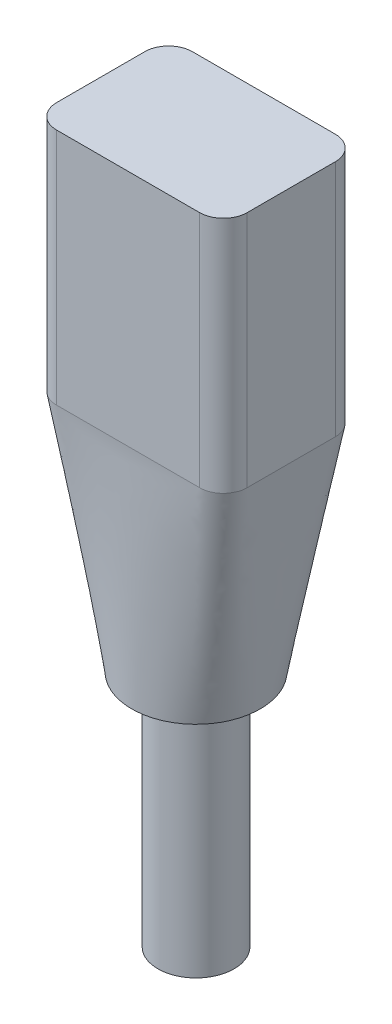
ISO-10303-21;
HEADER;
FILE_DESCRIPTION(('STEP AP214'),'2;1');
FILE_NAME('part.step','',(''),(''),'','','');
FILE_SCHEMA(('AUTOMOTIVE_DESIGN { 1 0 10303 214 1 1 1 1 }'));
ENDSEC;
DATA;
#1=APPLICATION_CONTEXT('core data for automotive mechanical design processes');
#2=APPLICATION_PROTOCOL_DEFINITION('international standard','automotive_design',2000,#1);
#3=PRODUCT_CONTEXT('',#1,'mechanical');
#4=PRODUCT('Part','Part','',(#3));
#5=PRODUCT_RELATED_PRODUCT_CATEGORY('part','',(#4));
#6=PRODUCT_DEFINITION_FORMATION('','',#4);
#7=PRODUCT_DEFINITION_CONTEXT('part definition',#1,'design');
#8=PRODUCT_DEFINITION('design','',#6,#7);
#9=PRODUCT_DEFINITION_SHAPE('','',#8);
#10=(LENGTH_UNIT() NAMED_UNIT(*) SI_UNIT(.MILLI.,.METRE.));
#11=(NAMED_UNIT(*) PLANE_ANGLE_UNIT() SI_UNIT($,.RADIAN.));
#12=(NAMED_UNIT(*) SI_UNIT($,.STERADIAN.) SOLID_ANGLE_UNIT());
#13=UNCERTAINTY_MEASURE_WITH_UNIT(LENGTH_MEASURE(1.E-05),#10,'distance_accuracy_value','');
#14=(GEOMETRIC_REPRESENTATION_CONTEXT(3) GLOBAL_UNCERTAINTY_ASSIGNED_CONTEXT((#13)) GLOBAL_UNIT_ASSIGNED_CONTEXT((#10,
#11,#12)) REPRESENTATION_CONTEXT('',''));
#15=CARTESIAN_POINT('',(0.,0.,0.));
#16=DIRECTION('',(0.,0.,1.));
#17=DIRECTION('',(1.,0.,0.));
#18=AXIS2_PLACEMENT_3D('',#15,#16,#17);
#19=CARTESIAN_POINT('',(-5.08,-12.7,-3.6195));
#20=DIRECTION('',(-1.,0.,0.));
#21=DIRECTION('',(0.,0.,1.));
#22=AXIS2_PLACEMENT_3D('',#19,#20,#21);
#23=PLANE('',#22);
#24=DIRECTION('',(0.,0.,1.));
#25=VECTOR('',#24,1.);
#26=CARTESIAN_POINT('',(-5.08,-12.7,-3.6195));
#27=LINE('',#26,#25);
#28=CARTESIAN_POINT('',(-5.08,-12.7,-2.3495));
#29=VERTEX_POINT('',#28);
#30=CARTESIAN_POINT('',(-5.08,-12.7,2.34949999999864));
#31=VERTEX_POINT('',#30);
#32=EDGE_CURVE('E347',#29,#31,#27,.T.);
#33=ORIENTED_EDGE('',*,*,#32,.T.);
#34=DIRECTION('',(0.,1.,0.));
#35=VECTOR('',#34,1.);
#36=CARTESIAN_POINT('',(-5.08,-12.7,2.3495));
#37=LINE('',#36,#35);
#38=CARTESIAN_POINT('',(-5.08,0.,2.3495));
#39=VERTEX_POINT('',#38);
#40=EDGE_CURVE('E353',#31,#39,#37,.T.);
#41=ORIENTED_EDGE('',*,*,#40,.T.);
#42=DIRECTION('',(0.,0.,1.));
#43=VECTOR('',#42,1.);
#44=CARTESIAN_POINT('',(-5.08,0.,-3.6195));
#45=LINE('',#44,#43);
#46=CARTESIAN_POINT('',(-5.08,0.,-2.3495));
#47=VERTEX_POINT('',#46);
#48=EDGE_CURVE('E349',#47,#39,#45,.T.);
#49=ORIENTED_EDGE('',*,*,#48,.F.);
#50=DIRECTION('',(0.,1.,0.));
#51=VECTOR('',#50,1.);
#52=CARTESIAN_POINT('',(-5.08,-12.7,-2.3495));
#53=LINE('',#52,#51);
#54=EDGE_CURVE('E369',#47,#29,#53,.F.);
#55=ORIENTED_EDGE('',*,*,#54,.T.);
#56=EDGE_LOOP('',(#33,#41,#49,#55));
#57=FACE_BOUND('',#56,.T.);
#58=ADVANCED_FACE('F227',(#57),#23,.T.);
#59=CARTESIAN_POINT('',(-5.08,-12.7,-3.6195));
#60=DIRECTION('',(0.,0.,-1.));
#61=DIRECTION('',(-1.,0.,0.));
#62=AXIS2_PLACEMENT_3D('',#59,#60,#61);
#63=PLANE('',#62);
#64=DIRECTION('',(-1.,0.,0.));
#65=VECTOR('',#64,1.);
#66=CARTESIAN_POINT('',(-5.08,-12.7,-3.6195));
#67=LINE('',#66,#65);
#68=CARTESIAN_POINT('',(3.81,-12.7,-3.6195));
#69=VERTEX_POINT('',#68);
#70=CARTESIAN_POINT('',(-3.80999999998039,-12.7,-3.6195));
#71=VERTEX_POINT('',#70);
#72=EDGE_CURVE('E372',#69,#71,#67,.T.);
#73=ORIENTED_EDGE('',*,*,#72,.T.);
#74=DIRECTION('',(0.,1.,0.));
#75=VECTOR('',#74,1.);
#76=CARTESIAN_POINT('',(-3.81,-12.7,-3.6195));
#77=LINE('',#76,#75);
#78=CARTESIAN_POINT('',(-3.81,0.,-3.6195));
#79=VERTEX_POINT('',#78);
#80=EDGE_CURVE('E360',#71,#79,#77,.T.);
#81=ORIENTED_EDGE('',*,*,#80,.T.);
#82=DIRECTION('',(-1.,0.,0.));
#83=VECTOR('',#82,1.);
#84=CARTESIAN_POINT('',(-5.08,0.,-3.6195));
#85=LINE('',#84,#83);
#86=CARTESIAN_POINT('',(3.81,0.,-3.6195));
#87=VERTEX_POINT('',#86);
#88=EDGE_CURVE('E344',#87,#79,#85,.T.);
#89=ORIENTED_EDGE('',*,*,#88,.F.);
#90=DIRECTION('',(0.,1.,0.));
#91=VECTOR('',#90,1.);
#92=CARTESIAN_POINT('',(3.81,-12.7,-3.6195));
#93=LINE('',#92,#91);
#94=EDGE_CURVE('E329',#87,#69,#93,.F.);
#95=ORIENTED_EDGE('',*,*,#94,.T.);
#96=EDGE_LOOP('',(#73,#81,#89,#95));
#97=FACE_BOUND('',#96,.T.);
#98=ADVANCED_FACE('F471',(#97),#63,.T.);
#99=CARTESIAN_POINT('',(5.08,-12.7,-3.6195));
#100=DIRECTION('',(1.,0.,0.));
#101=DIRECTION('',(0.,0.,-1.));
#102=AXIS2_PLACEMENT_3D('',#99,#100,#101);
#103=PLANE('',#102);
#104=DIRECTION('',(0.,0.,-1.));
#105=VECTOR('',#104,1.);
#106=CARTESIAN_POINT('',(5.08,-12.7,-3.6195));
#107=LINE('',#106,#105);
#108=CARTESIAN_POINT('',(5.08,-12.7,2.3495));
#109=VERTEX_POINT('',#108);
#110=CARTESIAN_POINT('',(5.08,-12.7,-2.3495));
#111=VERTEX_POINT('',#110);
#112=EDGE_CURVE('E232',#109,#111,#107,.T.);
#113=ORIENTED_EDGE('',*,*,#112,.T.);
#114=DIRECTION('',(0.,1.,0.));
#115=VECTOR('',#114,1.);
#116=CARTESIAN_POINT('',(5.08,-12.7,-2.3495));
#117=LINE('',#116,#115);
#118=CARTESIAN_POINT('',(5.08,0.,-2.3495));
#119=VERTEX_POINT('',#118);
#120=EDGE_CURVE('E12',#111,#119,#117,.T.);
#121=ORIENTED_EDGE('',*,*,#120,.T.);
#122=DIRECTION('',(0.,0.,-1.));
#123=VECTOR('',#122,1.);
#124=CARTESIAN_POINT('',(5.08,0.,-3.6195));
#125=LINE('',#124,#123);
#126=CARTESIAN_POINT('',(5.08,0.,2.3495));
#127=VERTEX_POINT('',#126);
#128=EDGE_CURVE('E339',#127,#119,#125,.T.);
#129=ORIENTED_EDGE('',*,*,#128,.F.);
#130=DIRECTION('',(0.,1.,0.));
#131=VECTOR('',#130,1.);
#132=CARTESIAN_POINT('',(5.08,-12.7,2.3495));
#133=LINE('',#132,#131);
#134=EDGE_CURVE('E237',#127,#109,#133,.F.);
#135=ORIENTED_EDGE('',*,*,#134,.T.);
#136=EDGE_LOOP('',(#113,#121,#129,#135));
#137=FACE_BOUND('',#136,.T.);
#138=ADVANCED_FACE('F338',(#137),#103,.T.);
#139=CARTESIAN_POINT('',(-5.08,-12.7,3.6195));
#140=DIRECTION('',(0.,0.,1.));
#141=DIRECTION('',(1.,0.,0.));
#142=AXIS2_PLACEMENT_3D('',#139,#140,#141);
#143=PLANE('',#142);
#144=DIRECTION('',(1.,0.,0.));
#145=VECTOR('',#144,1.);
#146=CARTESIAN_POINT('',(-5.08,0.,3.6195));
#147=LINE('',#146,#145);
#148=CARTESIAN_POINT('',(-3.81,0.,3.6195));
#149=VERTEX_POINT('',#148);
#150=CARTESIAN_POINT('',(3.81,0.,3.6195));
#151=VERTEX_POINT('',#150);
#152=EDGE_CURVE('E345',#149,#151,#147,.T.);
#153=ORIENTED_EDGE('',*,*,#152,.F.);
#154=DIRECTION('',(0.,1.,0.));
#155=VECTOR('',#154,1.);
#156=CARTESIAN_POINT('',(-3.81,-12.7,3.6195));
#157=LINE('',#156,#155);
#158=CARTESIAN_POINT('',(-3.81,-12.7,3.6195));
#159=VERTEX_POINT('',#158);
#160=EDGE_CURVE('E363',#149,#159,#157,.F.);
#161=ORIENTED_EDGE('',*,*,#160,.T.);
#162=DIRECTION('',(1.,0.,0.));
#163=VECTOR('',#162,1.);
#164=CARTESIAN_POINT('',(-5.08,-12.7,3.6195));
#165=LINE('',#164,#163);
#166=CARTESIAN_POINT('',(3.81,-12.7,3.6195));
#167=VERTEX_POINT('',#166);
#168=EDGE_CURVE('E381',#159,#167,#165,.T.);
#169=ORIENTED_EDGE('',*,*,#168,.T.);
#170=DIRECTION('',(0.,1.,0.));
#171=VECTOR('',#170,1.);
#172=CARTESIAN_POINT('',(3.81,-12.7,3.6195));
#173=LINE('',#172,#171);
#174=EDGE_CURVE('E358',#167,#151,#173,.T.);
#175=ORIENTED_EDGE('',*,*,#174,.T.);
#176=EDGE_LOOP('',(#153,#161,#169,#175));
#177=FACE_BOUND('',#176,.T.);
#178=ADVANCED_FACE('F479',(#177),#143,.T.);
#179=CARTESIAN_POINT('',(0.,0.,0.));
#180=DIRECTION('',(0.,1.,0.));
#181=DIRECTION('',(0.,0.,1.));
#182=AXIS2_PLACEMENT_3D('',#179,#180,#181);
#183=PLANE('',#182);
#184=ORIENTED_EDGE('',*,*,#48,.T.);
#185=CARTESIAN_POINT('',(-3.81,0.,2.3495));
#186=DIRECTION('',(0.,1.,0.));
#187=DIRECTION('',(0.,0.,1.));
#188=AXIS2_PLACEMENT_3D('',#185,#186,#187);
#189=CIRCLE('',#188,1.27);
#190=EDGE_CURVE('E356',#39,#149,#189,.T.);
#191=ORIENTED_EDGE('',*,*,#190,.T.);
#192=ORIENTED_EDGE('',*,*,#152,.T.);
#193=CARTESIAN_POINT('',(3.81,0.,2.3495));
#194=DIRECTION('',(0.,1.,0.));
#195=DIRECTION('',(0.,0.,1.));
#196=AXIS2_PLACEMENT_3D('',#193,#194,#195);
#197=CIRCLE('',#196,1.27);
#198=EDGE_CURVE('E334',#151,#127,#197,.T.);
#199=ORIENTED_EDGE('',*,*,#198,.T.);
#200=ORIENTED_EDGE('',*,*,#128,.T.);
#201=CARTESIAN_POINT('',(3.81,0.,-2.3495));
#202=DIRECTION('',(0.,1.,0.));
#203=DIRECTION('',(0.,0.,1.));
#204=AXIS2_PLACEMENT_3D('',#201,#202,#203);
#205=CIRCLE('',#204,1.27);
#206=EDGE_CURVE('E326',#119,#87,#205,.T.);
#207=ORIENTED_EDGE('',*,*,#206,.T.);
#208=ORIENTED_EDGE('',*,*,#88,.T.);
#209=CARTESIAN_POINT('',(-3.81,0.,-2.3495));
#210=DIRECTION('',(0.,1.,0.));
#211=DIRECTION('',(0.,0.,1.));
#212=AXIS2_PLACEMENT_3D('',#209,#210,#211);
#213=CIRCLE('',#212,1.27);
#214=EDGE_CURVE('E254',#79,#47,#213,.T.);
#215=ORIENTED_EDGE('',*,*,#214,.T.);
#216=EDGE_LOOP('',(#184,#191,#192,#199,#200,#207,#208,#215));
#217=FACE_BOUND('',#216,.T.);
#218=ADVANCED_FACE('F342',(#217),#183,.T.);
#219=CARTESIAN_POINT('',(-3.81,-12.7,2.3495));
#220=DIRECTION('',(0.,1.,0.));
#221=DIRECTION('',(0.,0.,1.));
#222=AXIS2_PLACEMENT_3D('',#219,#220,#221);
#223=CYLINDRICAL_SURFACE('',#222,1.27);
#224=CARTESIAN_POINT('',(-3.81000000000032,-12.7,3.6195));
#225=CARTESIAN_POINT('',(-3.82785191917642,-12.7000193499349,3.61950011683258));
#226=CARTESIAN_POINT('',(-3.84570103696801,-12.7002239515164,3.61912358872368));
#227=CARTESIAN_POINT('',(-3.88136625776914,-12.7007886712782,3.61761883209057));
#228=CARTESIAN_POINT('',(-3.89918235917228,-12.7011487968357,3.61649056790617));
#229=CARTESIAN_POINT('',(-3.93474418231002,-12.701809381901,3.61348462654775));
#230=CARTESIAN_POINT('',(-3.95248993286943,-12.702109869021,3.61160729740527));
#231=CARTESIAN_POINT('',(-3.98788705216084,-12.7025529482621,3.60710669181182));
#232=CARTESIAN_POINT('',(-4.0055384244881,-12.702695546441,3.60448344398539));
#233=CARTESIAN_POINT('',(-4.05828273857642,-12.7028085385177,3.59550426741488));
#234=CARTESIAN_POINT('',(-4.09319360234731,-12.7024648407007,3.58803655849395));
#235=CARTESIAN_POINT('',(-4.16225257597011,-12.7012033336999,3.57019262043896));
#236=CARTESIAN_POINT('',(-4.19640063774621,-12.7002854884356,3.55981620853839));
#237=CARTESIAN_POINT('',(-4.24688843294884,-12.6990932954439,3.54212196166854));
#238=CARTESIAN_POINT('',(-4.26360409209781,-12.6987265129961,3.53586500896526));
#239=CARTESIAN_POINT('',(-4.2967605979294,-12.6982227320734,3.52265067222018));
#240=CARTESIAN_POINT('',(-4.31320145550908,-12.6980857244654,3.51569331602954));
#241=CARTESIAN_POINT('',(-4.34577484981715,-12.6980561357246,3.50109188475384));
#242=CARTESIAN_POINT('',(-4.36190739245442,-12.6981635499026,3.49344782284559));
#243=CARTESIAN_POINT('',(-4.39383449040807,-12.6984938179662,3.47748755817256));
#244=CARTESIAN_POINT('',(-4.40962903168678,-12.6987166766368,3.46917132755995));
#245=CARTESIAN_POINT('',(-4.45645426318381,-12.6994455612716,3.44324090352426));
#246=CARTESIAN_POINT('',(-4.48694382936055,-12.700012067434,3.42463723422937));
#247=CARTESIAN_POINT('',(-4.54624663088929,-12.700912055996,3.38492968559296));
#248=CARTESIAN_POINT('',(-4.57505989032358,-12.7012455417439,3.36382584218288));
#249=CARTESIAN_POINT('',(-4.63064459138849,-12.7015606067847,3.31939726595767));
#250=CARTESIAN_POINT('',(-4.65742708851336,-12.7015442531216,3.29608638808376));
#251=CARTESIAN_POINT('',(-4.7089465915668,-12.7012756119455,3.24730483113287));
#252=CARTESIAN_POINT('',(-4.73368356028614,-12.7010233201417,3.22183411278433));
#253=CARTESIAN_POINT('',(-4.78093853046815,-12.700265221155,3.16891265705702));
#254=CARTESIAN_POINT('',(-4.8034563423054,-12.6997593923299,3.14146175081909));
#255=CARTESIAN_POINT('',(-4.84611635428077,-12.6986627965061,3.08476929564828));
#256=CARTESIAN_POINT('',(-4.86625861570685,-12.6980720316996,3.05552779294145));
#257=CARTESIAN_POINT('',(-4.89463321448037,-12.697419706931,3.0104003304514));
#258=CARTESIAN_POINT('',(-4.90380853542598,-12.6972410630343,2.99510137900231));
#259=CARTESIAN_POINT('',(-4.92150744988578,-12.6970372788857,2.9641293161236));
#260=CARTESIAN_POINT('',(-4.930031068617,-12.6970121326914,2.94845621920203));
#261=CARTESIAN_POINT('',(-4.94641115897224,-12.6971950511334,2.91676351719255));
#262=CARTESIAN_POINT('',(-4.95426754504337,-12.6974031456275,2.90074386799895));
#263=CARTESIAN_POINT('',(-4.96929578683642,-12.6981671967656,2.86839442962313));
#264=CARTESIAN_POINT('',(-4.97646761848739,-12.6987231656367,2.85206462955928));
#265=CARTESIAN_POINT('',(-4.99011267101932,-12.6999717301686,2.81912925284985));
#266=CARTESIAN_POINT('',(-4.99658618255505,-12.7006642686443,2.80252379428553));
#267=CARTESIAN_POINT('',(-5.00882893680099,-12.7020019375051,2.76905554786393));
#268=CARTESIAN_POINT('',(-5.01459820004213,-12.7026470692721,2.75219276752448));
#269=CARTESIAN_POINT('',(-5.03083027449232,-12.7042964310123,2.7012688820704));
#270=CARTESIAN_POINT('',(-5.04022751685431,-12.7050160080144,2.66684774038221));
#271=CARTESIAN_POINT('',(-5.05344755148205,-12.7052315084487,2.60892953024577));
#272=CARTESIAN_POINT('',(-5.05808443678673,-12.7050552759196,2.58561426207882));
#273=CARTESIAN_POINT('',(-5.06604242081595,-12.7042910060763,2.53876636869477));
#274=CARTESIAN_POINT('',(-5.06936353066868,-12.703702972245,2.51523374531768));
#275=CARTESIAN_POINT('',(-5.07467847043188,-12.7023703552846,2.46804072917893));
#276=CARTESIAN_POINT('',(-5.07667323363999,-12.7016258827217,2.44438043809559));
#277=CARTESIAN_POINT('',(-5.07933398259116,-12.7004554511909,2.39698317802484));
#278=CARTESIAN_POINT('',(-5.08000023111397,-12.700029429244,2.3732462251317));
#279=CARTESIAN_POINT('',(-5.08,-12.7,2.34949999999728));
#280=B_SPLINE_CURVE_WITH_KNOTS('',3,(#224,#225,#226,#227,#228,#229,#230,#231,#232,#233,#234,
#235,#236,#237,#238,#239,#240,#241,#242,#243,#244,#245,#246,#247,#248,#249,#250,#251,#252,#253,
#254,#255,#256,#257,#258,#259,#260,#261,#262,#263,#264,#265,#266,#267,#268,#269,#270,#271,#272,
#273,#274,#275,#276,#277,#278,#279),.UNSPECIFIED.,.F.,.F.,(4,2,2,2,2,2,2,2,2,2,2,2,2,2,2,2,2,2,
2,2,2,2,2,2,2,2,2,4),(0.,0.0535475170581482,0.107097574436909,0.160622780237025,
0.214145932291212,0.321109027564496,0.428078845303761,0.481621278339773,0.535161583130668,
0.58870086078676,0.642242357705069,0.749268755249208,0.85629361484177,0.962686288185609,
1.06908089644234,1.17548458817631,1.28188553415,1.33539302985421,1.38889845408494,
1.4424107284819,1.49592488383444,1.54941667887891,1.60290691410644,1.70980799578122,
1.78108795335472,1.85236730806393,1.92359645308274,1.99481150760326),.UNSPECIFIED.);
#281=EDGE_CURVE('E374',#159,#31,#280,.T.);
#282=ORIENTED_EDGE('',*,*,#281,.F.);
#283=ORIENTED_EDGE('',*,*,#160,.F.);
#284=ORIENTED_EDGE('',*,*,#190,.F.);
#285=ORIENTED_EDGE('',*,*,#40,.F.);
#286=EDGE_LOOP('',(#282,#283,#284,#285));
#287=FACE_BOUND('',#286,.T.);
#288=ADVANCED_FACE('F458',(#287),#223,.T.);
#289=CARTESIAN_POINT('',(-3.81,-12.7,-2.3495));
#290=DIRECTION('',(0.,1.,0.));
#291=DIRECTION('',(0.,0.,1.));
#292=AXIS2_PLACEMENT_3D('',#289,#290,#291);
#293=CYLINDRICAL_SURFACE('',#292,1.27);
#294=CARTESIAN_POINT('',(-5.08,-12.7,-2.34949999991347));
#295=CARTESIAN_POINT('',(-5.08000011063295,-12.7000091921465,-2.36735982363288));
#296=CARTESIAN_POINT('',(-5.0796232570443,-12.7002572858356,-2.38521535779433));
#297=CARTESIAN_POINT('',(-5.0781175893252,-12.7010062257201,-2.4208892484536));
#298=CARTESIAN_POINT('',(-5.07698880334756,-12.7015070624524,-2.43870760631828));
#299=CARTESIAN_POINT('',(-5.07398164235616,-12.7025363339921,-2.47427511028815));
#300=CARTESIAN_POINT('',(-5.07210346874928,-12.7030647613511,-2.49202427369696));
#301=CARTESIAN_POINT('',(-5.06760071942922,-12.7039961107308,-2.52742978552736));
#302=CARTESIAN_POINT('',(-5.06497615600962,-12.7043990348185,-2.54508613547278));
#303=CARTESIAN_POINT('',(-5.05599120362284,-12.7052449499517,-2.59784966798296));
#304=CARTESIAN_POINT('',(-5.04851701716056,-12.7053263694605,-2.63278129639566));
#305=CARTESIAN_POINT('',(-5.03065756864486,-12.7043290692299,-2.70187612441862));
#306=CARTESIAN_POINT('',(-5.02027199415224,-12.7032502249402,-2.73603924112981));
#307=CARTESIAN_POINT('',(-5.00256865777317,-12.7013209845814,-2.78653425454667));
#308=CARTESIAN_POINT('',(-4.99630865630682,-12.7006255261085,-2.80325152705573));
#309=CARTESIAN_POINT('',(-4.98308856704644,-12.6992995685177,-2.83641033697837));
#310=CARTESIAN_POINT('',(-4.9761285209025,-12.6986690655396,-2.85285189072837));
#311=CARTESIAN_POINT('',(-4.96151891115244,-12.6977215927962,-2.88543169940895));
#312=CARTESIAN_POINT('',(-4.95386948335196,-12.6974045614249,-2.90157001332294));
#313=CARTESIAN_POINT('',(-4.93789605543682,-12.6970518537527,-2.93351155803859));
#314=CARTESIAN_POINT('',(-4.92957202125053,-12.6970161916716,-2.9493147718648));
#315=CARTESIAN_POINT('',(-4.90361761833299,-12.6971681064196,-2.99616396314081));
#316=CARTESIAN_POINT('',(-4.88499686119622,-12.6976142593706,-3.02666752082151));
#317=CARTESIAN_POINT('',(-4.84525237287888,-12.6986607741201,-3.08599728045676));
#318=CARTESIAN_POINT('',(-4.82412810670966,-12.6992611689115,-3.11482312192138));
#319=CARTESIAN_POINT('',(-4.77979243358714,-12.7002773278402,-3.17025994056578));
#320=CARTESIAN_POINT('',(-4.75660922744011,-12.7006952285141,-3.19689341159178));
#321=CARTESIAN_POINT('',(-4.70810675116857,-12.7012898393158,-3.24813721765304));
#322=CARTESIAN_POINT('',(-4.68278765009816,-12.7014665685132,-3.27274771250113));
#323=CARTESIAN_POINT('',(-4.63018327630337,-12.7015476151081,-3.31978059264586));
#324=CARTESIAN_POINT('',(-4.60289762877667,-12.7014518804424,-3.34220255890551));
#325=CARTESIAN_POINT('',(-4.54655467768323,-12.700927424684,-3.38469675868059));
#326=CARTESIAN_POINT('',(-4.51749726823965,-12.7004986836735,-3.40476885156274));
#327=CARTESIAN_POINT('',(-4.4575541160535,-12.6994971849009,-3.44258769354971));
#328=CARTESIAN_POINT('',(-4.42665461061673,-12.6989232009051,-3.46031258044468));
#329=CARTESIAN_POINT('',(-4.36347240852764,-12.6981303668283,-3.4931059164676));
#330=CARTESIAN_POINT('',(-4.33118989777306,-12.6979114691708,-3.50817472123092));
#331=CARTESIAN_POINT('',(-4.2654980189181,-12.6985613219576,-3.53553863292688));
#332=CARTESIAN_POINT('',(-4.23208910129435,-12.6994296425025,-3.54783483391258));
#333=CARTESIAN_POINT('',(-4.16436065238176,-12.7010970945011,-3.5695790637036));
#334=CARTESIAN_POINT('',(-4.13004127807988,-12.7018962377826,-3.57902758009709));
#335=CARTESIAN_POINT('',(-4.07199426397686,-12.7026426374711,-3.59241412823473));
#336=CARTESIAN_POINT('',(-4.04844953664011,-12.7027823544769,-3.59714505489341));
#337=CARTESIAN_POINT('',(-4.00113292283068,-12.7026911058883,-3.60526440233674));
#338=CARTESIAN_POINT('',(-3.97736106673197,-12.7024601891879,-3.60865300012745));
#339=CARTESIAN_POINT('',(-3.92969766653269,-12.7017430226215,-3.61407386396179));
#340=CARTESIAN_POINT('',(-3.9058063149383,-12.7012571004672,-3.61610786322767));
#341=CARTESIAN_POINT('',(-3.86991194050898,-12.7006060720282,-3.61814267769481));
#342=CARTESIAN_POINT('',(-3.85793662563014,-12.7004020250666,-3.61865158516433));
#343=CARTESIAN_POINT('',(-3.83397473693634,-12.7001007129684,-3.61933024933811));
#344=CARTESIAN_POINT('',(-3.82198816273237,-12.7000034516682,-3.61949999385805));
#345=CARTESIAN_POINT('',(-3.80999999996079,-12.7,-3.6195));
#346=B_SPLINE_CURVE_WITH_KNOTS('',3,(#294,#295,#296,#297,#298,#299,#300,#301,#302,#303,#304,
#305,#306,#307,#308,#309,#310,#311,#312,#313,#314,#315,#316,#317,#318,#319,#320,#321,#322,#323,
#324,#325,#326,#327,#328,#329,#330,#331,#332,#333,#334,#335,#336,#337,#338,#339,#340,#341,#342,
#343,#344,#345),.UNSPECIFIED.,.F.,.F.,(4,2,2,2,2,2,2,2,2,2,2,2,2,2,2,2,2,2,2,2,2,2,2,2,2,4),(0.,
0.0535682745791533,0.107134543642069,0.160686425817909,0.214237426007252,0.321249445453936,
0.428272953426274,0.481853902618608,0.535431665824858,0.588998897384116,0.642568836093322,
0.74964962410285,0.856753336197993,0.962567130783647,1.06837255814963,1.17419820447558,
1.28003018093374,1.38678734423696,1.4935302024432,1.6002308665509,1.7069132506931,1.77892165409,
1.85092055894285,1.92282716257851,1.95878624972736,1.99474662867116),.UNSPECIFIED.);
#347=EDGE_CURVE('E449',#29,#71,#346,.T.);
#348=ORIENTED_EDGE('',*,*,#347,.F.);
#349=ORIENTED_EDGE('',*,*,#54,.F.);
#350=ORIENTED_EDGE('',*,*,#214,.F.);
#351=ORIENTED_EDGE('',*,*,#80,.F.);
#352=EDGE_LOOP('',(#348,#349,#350,#351));
#353=FACE_BOUND('',#352,.T.);
#354=ADVANCED_FACE('F455',(#353),#293,.T.);
#355=CARTESIAN_POINT('',(3.81,-12.7,-2.3495));
#356=DIRECTION('',(0.,1.,0.));
#357=DIRECTION('',(0.,0.,1.));
#358=AXIS2_PLACEMENT_3D('',#355,#356,#357);
#359=CYLINDRICAL_SURFACE('',#358,1.27);
#360=CARTESIAN_POINT('',(3.81000000000032,-12.7,-3.6195));
#361=CARTESIAN_POINT('',(3.82785191917642,-12.7000193499349,-3.61950011683258));
#362=CARTESIAN_POINT('',(3.84570103696801,-12.7002239515164,-3.61912358872368));
#363=CARTESIAN_POINT('',(3.88136625776914,-12.7007886712781,-3.61761883209057));
#364=CARTESIAN_POINT('',(3.89918235917228,-12.7011487968357,-3.61649056790617));
#365=CARTESIAN_POINT('',(3.93474418231002,-12.701809381901,-3.61348462654775));
#366=CARTESIAN_POINT('',(3.95248993286943,-12.702109869021,-3.61160729740527));
#367=CARTESIAN_POINT('',(3.98788705216084,-12.7025529482621,-3.60710669181182));
#368=CARTESIAN_POINT('',(4.0055384244881,-12.702695546441,-3.60448344398539));
#369=CARTESIAN_POINT('',(4.05828273857642,-12.7028085385177,-3.59550426741488));
#370=CARTESIAN_POINT('',(4.09319360234731,-12.7024648407007,-3.58803655849395));
#371=CARTESIAN_POINT('',(4.16225257597011,-12.7012033336999,-3.57019262043897));
#372=CARTESIAN_POINT('',(4.19640063774622,-12.7002854884356,-3.55981620853839));
#373=CARTESIAN_POINT('',(4.24688843294884,-12.6990932954439,-3.54212196166854));
#374=CARTESIAN_POINT('',(4.26360409209781,-12.6987265129961,-3.53586500896526));
#375=CARTESIAN_POINT('',(4.29676059792941,-12.6982227320734,-3.52265067222018));
#376=CARTESIAN_POINT('',(4.31320145550908,-12.6980857244654,-3.51569331602954));
#377=CARTESIAN_POINT('',(4.34577484981715,-12.6980561357246,-3.50109188475384));
#378=CARTESIAN_POINT('',(4.36190739245442,-12.6981635499026,-3.49344782284559));
#379=CARTESIAN_POINT('',(4.39383449040807,-12.6984938179663,-3.47748755817256));
#380=CARTESIAN_POINT('',(4.40962903168678,-12.6987166766369,-3.46917132755995));
#381=CARTESIAN_POINT('',(4.45645426318381,-12.6994455612716,-3.44324090352426));
#382=CARTESIAN_POINT('',(4.48694382936055,-12.700012067434,-3.42463723422937));
#383=CARTESIAN_POINT('',(4.54624663088929,-12.700912055996,-3.38492968559295));
#384=CARTESIAN_POINT('',(4.57505989032359,-12.7012455417439,-3.36382584218288));
#385=CARTESIAN_POINT('',(4.6306445913885,-12.7015606067847,-3.31939726595767));
#386=CARTESIAN_POINT('',(4.65742708851336,-12.7015442531216,-3.29608638808376));
#387=CARTESIAN_POINT('',(4.7089465915668,-12.7012756119455,-3.24730483113286));
#388=CARTESIAN_POINT('',(4.73368356028614,-12.7010233201417,-3.22183411278432));
#389=CARTESIAN_POINT('',(4.78093853046816,-12.700265221155,-3.16891265705701));
#390=CARTESIAN_POINT('',(4.80345634230541,-12.6997593923299,-3.14146175081908));
#391=CARTESIAN_POINT('',(4.84611635428078,-12.6986627965061,-3.08476929564827));
#392=CARTESIAN_POINT('',(4.86625861570686,-12.6980720316996,-3.05552779294143));
#393=CARTESIAN_POINT('',(4.89463321448038,-12.697419706931,-3.01040033045138));
#394=CARTESIAN_POINT('',(4.90380853542599,-12.6972410630343,-2.99510137900229));
#395=CARTESIAN_POINT('',(4.92150744988579,-12.6970372788857,-2.96412931612359));
#396=CARTESIAN_POINT('',(4.93003106861701,-12.6970121326914,-2.94845621920202));
#397=CARTESIAN_POINT('',(4.94641115897225,-12.6971950511334,-2.91676351719253));
#398=CARTESIAN_POINT('',(4.95426754504338,-12.6974031456275,-2.90074386799893));
#399=CARTESIAN_POINT('',(4.96929578683642,-12.6981671967656,-2.86839442962311));
#400=CARTESIAN_POINT('',(4.9764676184874,-12.6987231656368,-2.85206462955926));
#401=CARTESIAN_POINT('',(4.99011267101932,-12.6999717301686,-2.81912925284983));
#402=CARTESIAN_POINT('',(4.99658618255506,-12.7006642686443,-2.80252379428551));
#403=CARTESIAN_POINT('',(5.008828936801,-12.7020019375051,-2.76905554786392));
#404=CARTESIAN_POINT('',(5.01459820004213,-12.7026470692721,-2.75219276752446));
#405=CARTESIAN_POINT('',(5.03083027449232,-12.7042964310123,-2.70126888207038));
#406=CARTESIAN_POINT('',(5.04022751685431,-12.7050160080143,-2.66684774038219));
#407=CARTESIAN_POINT('',(5.053447551482,-12.7052315084487,-2.60892953024597));
#408=CARTESIAN_POINT('',(5.05808443678664,-12.7050552759196,-2.58561426207925));
#409=CARTESIAN_POINT('',(5.06604242081581,-12.7042910060763,-2.53876636869566));
#410=CARTESIAN_POINT('',(5.06936353066853,-12.7037029722451,-2.5152337453188));
#411=CARTESIAN_POINT('',(5.07467847043173,-12.7023703552847,-2.46804072918051));
#412=CARTESIAN_POINT('',(5.07667323363985,-12.7016258827218,-2.44438043809739));
#413=CARTESIAN_POINT('',(5.07933398259108,-12.700455451191,-2.39698317802711));
#414=CARTESIAN_POINT('',(5.08000023111392,-12.7000294292441,-2.37324622513419));
#415=CARTESIAN_POINT('',(5.08,-12.7,-2.3495));
#416=B_SPLINE_CURVE_WITH_KNOTS('',3,(#360,#361,#362,#363,#364,#365,#366,#367,#368,#369,#370,
#371,#372,#373,#374,#375,#376,#377,#378,#379,#380,#381,#382,#383,#384,#385,#386,#387,#388,#389,
#390,#391,#392,#393,#394,#395,#396,#397,#398,#399,#400,#401,#402,#403,#404,#405,#406,#407,#408,
#409,#410,#411,#412,#413,#414,#415),.UNSPECIFIED.,.F.,.F.,(4,2,2,2,2,2,2,2,2,2,2,2,2,2,2,2,2,2,
2,2,2,2,2,2,2,2,2,4),(0.,0.0535475170581477,0.107097574436908,0.160622780237024,
0.214145932291211,0.321109027564496,0.428078845303761,0.481621278339773,0.535161583130669,
0.588700860786761,0.64224235770507,0.749268755249208,0.85629361484177,0.962686288185613,
1.06908089644235,1.17548458817632,1.28188553415002,1.33539302985422,1.38889845408495,
1.44241072848192,1.49592488383446,1.54941667887893,1.60290691410645,1.70980799578124,
1.78108795335405,1.85236730806258,1.9235964530807,1.99481150760054),.UNSPECIFIED.);
#417=EDGE_CURVE('E245',#69,#111,#416,.T.);
#418=ORIENTED_EDGE('',*,*,#417,.F.);
#419=ORIENTED_EDGE('',*,*,#94,.F.);
#420=ORIENTED_EDGE('',*,*,#206,.F.);
#421=ORIENTED_EDGE('',*,*,#120,.F.);
#422=EDGE_LOOP('',(#418,#419,#420,#421));
#423=FACE_BOUND('',#422,.T.);
#424=ADVANCED_FACE('F327',(#423),#359,.T.);
#425=CARTESIAN_POINT('',(3.81,-12.7,2.3495));
#426=DIRECTION('',(0.,1.,0.));
#427=DIRECTION('',(0.,0.,1.));
#428=AXIS2_PLACEMENT_3D('',#425,#426,#427);
#429=CYLINDRICAL_SURFACE('',#428,1.27);
#430=CARTESIAN_POINT('',(5.08,-12.7,2.3495));
#431=CARTESIAN_POINT('',(5.08000011069876,-12.7000092039954,2.36736551594073));
#432=CARTESIAN_POINT('',(5.07962301684566,-12.7002574500653,2.3852267382343));
#433=CARTESIAN_POINT('',(5.07811638983661,-12.7010067822513,2.42091197458062));
#434=CARTESIAN_POINT('',(5.0769868847493,-12.7015078589354,2.43873598999648));
#435=CARTESIAN_POINT('',(5.0739778115617,-12.702537503351,2.47431471908833));
#436=CARTESIAN_POINT('',(5.07209844630611,-12.7030660636144,2.49206945019592));
#437=CARTESIAN_POINT('',(5.06759284370256,-12.7039974726096,2.52748600998534));
#438=CARTESIAN_POINT('',(5.06496661870671,-12.7044003234203,2.54514784019871));
#439=CARTESIAN_POINT('',(5.0559759797012,-12.7052456292899,2.5979276628204));
#440=CARTESIAN_POINT('',(5.04849706740373,-12.7053261225363,2.63286992783118));
#441=CARTESIAN_POINT('',(5.03062638395349,-12.70432645795,2.70198528453513));
#442=CARTESIAN_POINT('',(5.02023429867292,-12.7032461749149,2.73615829284972));
#443=CARTESIAN_POINT('',(5.00251990934555,-12.7013156068899,2.78666748822365));
#444=CARTESIAN_POINT('',(4.99625600027274,-12.700619843658,2.80338939472125));
#445=CARTESIAN_POINT('',(4.98302767266888,-12.6992939135793,2.836557230017));
#446=CARTESIAN_POINT('',(4.97606329603866,-12.6986637428135,2.85300317525412));
#447=CARTESIAN_POINT('',(4.9614446233039,-12.697717723456,2.88559147836051));
#448=CARTESIAN_POINT('',(4.9537904630659,-12.6974018131115,2.9017338952619));
#449=CARTESIAN_POINT('',(4.9378071959364,-12.6970509893186,2.93368331493466));
#450=CARTESIAN_POINT('',(4.92947805472662,-12.6970160901669,2.94949030059996));
#451=CARTESIAN_POINT('',(4.90350782103624,-12.6971700373351,2.99635023930256));
#452=CARTESIAN_POINT('',(4.88487580055233,-12.6976172035377,3.02686026460729));
#453=CARTESIAN_POINT('',(4.84510750894267,-12.698664832369,3.08620141507264));
#454=CARTESIAN_POINT('',(4.82397070407108,-12.6992653277024,3.11503218043964));
#455=CARTESIAN_POINT('',(4.77961604198209,-12.7002808494439,3.17046831507512));
#456=CARTESIAN_POINT('',(4.75642713124809,-12.7006980762233,3.19709678322711));
#457=CARTESIAN_POINT('',(4.70791368862736,-12.7012914757522,3.24833012338433));
#458=CARTESIAN_POINT('',(4.68258932600212,-12.7014676675878,3.2729351554676));
#459=CARTESIAN_POINT('',(4.62997491612572,-12.7015472620749,3.31995668048919));
#460=CARTESIAN_POINT('',(4.60268449483867,-12.701450612685,3.34237275506505));
#461=CARTESIAN_POINT('',(4.54633251116559,-12.7009245986719,3.38485479512538));
#462=CARTESIAN_POINT('',(4.51727084282001,-12.7004952141258,3.40492061980298));
#463=CARTESIAN_POINT('',(4.45731956771705,-12.6994929877004,3.44272661014439));
#464=CARTESIAN_POINT('',(4.42641619770022,-12.6989189240798,3.46044490251381));
#465=CARTESIAN_POINT('',(4.36322681924668,-12.698128491692,3.49322474358956));
#466=CARTESIAN_POINT('',(4.33094099684722,-12.6979120749504,3.50828664837952));
#467=CARTESIAN_POINT('',(4.2652431849506,-12.6985659920673,3.53563647253106));
#468=CARTESIAN_POINT('',(4.23183164672464,-12.6994358953744,3.54792548861912));
#469=CARTESIAN_POINT('',(4.16409851577478,-12.7011035915483,3.56965516604041));
#470=CARTESIAN_POINT('',(4.12977708103573,-12.7019013968288,3.57909631836839));
#471=CARTESIAN_POINT('',(4.07174932852061,-12.7026445702059,3.59246529503553));
#472=CARTESIAN_POINT('',(4.04822602749775,-12.7027829320754,3.59718731393767));
#473=CARTESIAN_POINT('',(4.00095292401153,-12.702689749933,3.60529135136301));
#474=CARTESIAN_POINT('',(3.97720315177918,-12.7024582546238,3.60867354624073));
#475=CARTESIAN_POINT('',(3.92958436438618,-12.7017408828768,3.61408415239866));
#476=CARTESIAN_POINT('',(3.90571554147051,-12.7012553334202,3.61611429622565));
#477=CARTESIAN_POINT('',(3.86985511612233,-12.7006050975898,3.61814525245281));
#478=CARTESIAN_POINT('',(3.85789114775229,-12.7004013538361,3.61865319466173));
#479=CARTESIAN_POINT('',(3.83395198110814,-12.7001005224764,3.61933057150045));
#480=CARTESIAN_POINT('',(3.82197678244535,-12.7000034387096,3.61949999394597));
#481=CARTESIAN_POINT('',(3.81,-12.7,3.6195));
#482=B_SPLINE_CURVE_WITH_KNOTS('',3,(#430,#431,#432,#433,#434,#435,#436,#437,#438,#439,#440,
#441,#442,#443,#444,#445,#446,#447,#448,#449,#450,#451,#452,#453,#454,#455,#456,#457,#458,#459,
#460,#461,#462,#463,#464,#465,#466,#467,#468,#469,#470,#471,#472,#473,#474,#475,#476,#477,#478,
#479,#480,#481),.UNSPECIFIED.,.F.,.F.,(4,2,2,2,2,2,2,2,2,2,2,2,2,2,2,2,2,2,2,2,2,2,2,2,2,4),(0.,
0.0535853411238205,0.107168683362892,0.160737540588337,0.214305511905502,0.321351541347002,
0.428409118018363,0.482007209939625,0.535602097614395,0.589186451692159,0.642773531888938,
0.749888402386046,0.857026139231687,0.962839834090729,1.06864514974938,1.17447064793288,
1.28030248303523,1.38705985200915,1.49380289946898,1.60050365387287,1.70718600167493,
1.77912621832139,1.85105696267763,1.92289535519208,1.95882031200075,1.99474656182764),.UNSPECIFIED.);
#483=EDGE_CURVE('E366',#109,#167,#482,.T.);
#484=ORIENTED_EDGE('',*,*,#483,.F.);
#485=ORIENTED_EDGE('',*,*,#134,.F.);
#486=ORIENTED_EDGE('',*,*,#198,.F.);
#487=ORIENTED_EDGE('',*,*,#174,.F.);
#488=EDGE_LOOP('',(#484,#485,#486,#487));
#489=FACE_BOUND('',#488,.T.);
#490=ADVANCED_FACE('F229',(#489),#429,.T.);
#491=CARTESIAN_POINT('',(0.,-24.9174,0.));
#492=DIRECTION('',(0.,-1.,0.));
#493=DIRECTION('',(0.,0.,-1.));
#494=AXIS2_PLACEMENT_3D('',#491,#492,#493);
#495=PLANE('',#494);
#496=CARTESIAN_POINT('',(0.,-24.9174,0.));
#497=DIRECTION('',(0.,-1.,0.));
#498=DIRECTION('',(0.,0.,-1.));
#499=AXIS2_PLACEMENT_3D('',#496,#497,#498);
#500=CIRCLE('',#499,2.032);
#501=CARTESIAN_POINT('',(0.,-24.9174,-2.032));
#502=VERTEX_POINT('',#501);
#503=EDGE_CURVE('E557',#502,#502,#500,.T.);
#504=ORIENTED_EDGE('',*,*,#503,.F.);
#505=EDGE_LOOP('',(#504));
#506=FACE_BOUND('',#505,.T.);
#507=CARTESIAN_POINT('',(0.,-24.9174,0.));
#508=DIRECTION('',(0.,1.,0.));
#509=DIRECTION('',(0.,0.,-1.));
#510=AXIS2_PLACEMENT_3D('',#507,#508,#509);
#511=CIRCLE('',#510,3.429);
#512=CARTESIAN_POINT('',(2.35970735806498,-24.9174,-2.48793532558505));
#513=VERTEX_POINT('',#512);
#514=CARTESIAN_POINT('',(-2.35970735806292,-24.9174,-2.487935325587));
#515=VERTEX_POINT('',#514);
#516=EDGE_CURVE('E556',#513,#515,#511,.T.);
#517=ORIENTED_EDGE('',*,*,#516,.F.);
#518=CARTESIAN_POINT('',(0.,-24.9174,0.));
#519=DIRECTION('',(0.,1.,0.));
#520=DIRECTION('',(0.,0.,-1.));
#521=AXIS2_PLACEMENT_3D('',#518,#519,#520);
#522=CIRCLE('',#521,3.429);
#523=CARTESIAN_POINT('',(3.28253973867596,-24.9174,-0.991450384040045));
#524=VERTEX_POINT('',#523);
#525=EDGE_CURVE('E559',#524,#513,#522,.T.);
#526=ORIENTED_EDGE('',*,*,#525,.F.);
#527=CARTESIAN_POINT('',(0.,-24.9174,0.));
#528=DIRECTION('',(0.,1.,0.));
#529=DIRECTION('',(0.,0.,-1.));
#530=AXIS2_PLACEMENT_3D('',#527,#528,#529);
#531=CIRCLE('',#530,3.429);
#532=CARTESIAN_POINT('',(3.28253973866406,-24.9174,0.991450384079464));
#533=VERTEX_POINT('',#532);
#534=EDGE_CURVE('E623',#533,#524,#531,.T.);
#535=ORIENTED_EDGE('',*,*,#534,.F.);
#536=CARTESIAN_POINT('',(0.,-24.9174,0.));
#537=DIRECTION('',(0.,1.,0.));
#538=DIRECTION('',(0.,0.,-1.));
#539=AXIS2_PLACEMENT_3D('',#536,#537,#538);
#540=CIRCLE('',#539,3.429);
#541=CARTESIAN_POINT('',(2.35970735810136,-24.9174,2.48793532555055));
#542=VERTEX_POINT('',#541);
#543=EDGE_CURVE('E614',#542,#533,#540,.T.);
#544=ORIENTED_EDGE('',*,*,#543,.F.);
#545=CARTESIAN_POINT('',(0.,-24.9174,0.));
#546=DIRECTION('',(0.,1.,0.));
#547=DIRECTION('',(0.,0.,1.));
#548=AXIS2_PLACEMENT_3D('',#545,#546,#547);
#549=CIRCLE('',#548,3.429);
#550=CARTESIAN_POINT('',(-2.35970735808593,-24.9174,2.48793532556518));
#551=VERTEX_POINT('',#550);
#552=EDGE_CURVE('E605',#551,#542,#549,.T.);
#553=ORIENTED_EDGE('',*,*,#552,.F.);
#554=CARTESIAN_POINT('',(0.,-24.9174,0.));
#555=DIRECTION('',(0.,1.,0.));
#556=DIRECTION('',(0.,0.,-1.));
#557=AXIS2_PLACEMENT_3D('',#554,#555,#556);
#558=CIRCLE('',#557,3.429);
#559=CARTESIAN_POINT('',(-3.28253973864662,-24.9174,0.991450384137208));
#560=VERTEX_POINT('',#559);
#561=EDGE_CURVE('E586',#560,#551,#558,.T.);
#562=ORIENTED_EDGE('',*,*,#561,.F.);
#563=CARTESIAN_POINT('',(0.,-24.9174,0.));
#564=DIRECTION('',(0.,1.,0.));
#565=DIRECTION('',(0.,0.,1.));
#566=AXIS2_PLACEMENT_3D('',#563,#564,#565);
#567=CIRCLE('',#566,3.429);
#568=CARTESIAN_POINT('',(-3.28253973866868,-24.9174,-0.991450384064153));
#569=VERTEX_POINT('',#568);
#570=EDGE_CURVE('E584',#569,#560,#567,.T.);
#571=ORIENTED_EDGE('',*,*,#570,.F.);
#572=CARTESIAN_POINT('',(0.,-24.9174,0.));
#573=DIRECTION('',(0.,1.,0.));
#574=DIRECTION('',(0.,0.,1.));
#575=AXIS2_PLACEMENT_3D('',#572,#573,#574);
#576=CIRCLE('',#575,3.429);
#577=EDGE_CURVE('E288',#515,#569,#576,.T.);
#578=ORIENTED_EDGE('',*,*,#577,.F.);
#579=EDGE_LOOP('',(#517,#526,#535,#544,#553,#562,#571,#578));
#580=FACE_BOUND('',#579,.T.);
#581=ADVANCED_FACE('F391',(#506,#580),#495,.T.);
#582=CARTESIAN_POINT('',(-5.09797460261377,-12.577826,-2.36308049529684));
#583=CARTESIAN_POINT('',(-5.08,-12.7,-2.34949999914751));
#584=CARTESIAN_POINT('',(-3.28253973862333,-24.9174,-0.991450384214307));
#585=CARTESIAN_POINT('',(-5.0983188515679,-12.577826,-2.57435046681781));
#586=CARTESIAN_POINT('',(-5.08,-12.7,-2.55980665940825));
#587=CARTESIAN_POINT('',(-3.24811484320998,-24.9174,-1.10542591845196));
#588=CARTESIAN_POINT('',(-5.00425554495995,-12.577826,-2.91667540358069));
#589=CARTESIAN_POINT('',(-4.98600698823379,-12.7,-2.90118024854783));
#590=CARTESIAN_POINT('',(-3.16115131561732,-24.9174,-1.35166474526177));
#591=CARTESIAN_POINT('',(-4.72751674926316,-12.577826,-3.30089395266634));
#592=CARTESIAN_POINT('',(-4.70992172270462,-12.7,-3.28574553587849));
#593=CARTESIAN_POINT('',(-2.95041906685075,-24.9174,-1.77090385709312));
#594=CARTESIAN_POINT('',(-4.33805605261006,-12.577826,-3.55589251590178));
#595=CARTESIAN_POINT('',(-4.32146004984709,-12.7,-3.54226620166484));
#596=CARTESIAN_POINT('',(-2.66185977354984,-24.9174,-2.17963477797104));
#597=CARTESIAN_POINT('',(-4.01140631034034,-12.577826,-3.63174535908937));
#598=CARTESIAN_POINT('',(-3.99602338357832,-12.7,-3.6195));
#599=CARTESIAN_POINT('',(-2.45773070737638,-24.9174,-2.3949640910625));
#600=CARTESIAN_POINT('',(-3.20637335007344,-12.577826,-3.62774088863249));
#601=CARTESIAN_POINT('',(-3.19478077353625,-12.7,-3.6195));
#602=CARTESIAN_POINT('',(-2.03552311981683,-24.9174,-2.79541113675056));
#603=CARTESIAN_POINT('',(-1.9426209330657,-12.577826,-3.62301023993629));
#604=CARTESIAN_POINT('',(-1.93608485099466,-12.7,-3.6195));
#605=CARTESIAN_POINT('',(-1.28247664389082,-24.9174,-3.26847600637154));
#606=CARTESIAN_POINT('',(0.,-12.577826,-3.62060203407324));
#607=CARTESIAN_POINT('',(0.,-12.7,-3.6195));
#608=CARTESIAN_POINT('',(0.,-24.9174,-3.50929659267639));
#609=CARTESIAN_POINT('',(1.9426209330657,-12.577826,-3.62301023993628));
#610=CARTESIAN_POINT('',(1.93608485099466,-12.7,-3.6195));
#611=CARTESIAN_POINT('',(1.28247664389083,-24.9174,-3.26847600637154));
#612=CARTESIAN_POINT('',(3.20637335007344,-12.577826,-3.62774088863249));
#613=CARTESIAN_POINT('',(3.19478077353624,-12.7,-3.6195));
#614=CARTESIAN_POINT('',(2.03552311981683,-24.9174,-2.79541113675056));
#615=CARTESIAN_POINT('',(4.01140631034034,-12.577826,-3.63174535908937));
#616=CARTESIAN_POINT('',(3.99602338357832,-12.7,-3.6195));
#617=CARTESIAN_POINT('',(2.45773070737638,-24.9174,-2.3949640910625));
#618=CARTESIAN_POINT('',(4.33805662440706,-12.577826,-3.55589358048932));
#619=CARTESIAN_POINT('',(4.32146004984709,-12.7,-3.54226620166484));
#620=CARTESIAN_POINT('',(2.66180259385032,-24.9174,-2.17952831921672));
#621=CARTESIAN_POINT('',(4.72751656940408,-12.577826,-3.30089236355775));
#622=CARTESIAN_POINT('',(4.70992172270462,-12.7,-3.2857455358785));
#623=CARTESIAN_POINT('',(2.95043705275892,-24.9174,-1.77106276795345));
#624=CARTESIAN_POINT('',(5.00425577409773,-12.577826,-2.91667612822502));
#625=CARTESIAN_POINT('',(4.98600698823379,-12.7,-2.90118024854782));
#626=CARTESIAN_POINT('',(3.16112840183967,-24.9174,-1.35159228082792));
#627=CARTESIAN_POINT('',(5.0983188515679,-12.577826,-2.57435046681781));
#628=CARTESIAN_POINT('',(5.08,-12.7,-2.55980665940825));
#629=CARTESIAN_POINT('',(3.24811484320998,-24.9174,-1.10542591845196));
#630=CARTESIAN_POINT('',(5.0974057516342,-12.577826,-2.01396939761588));
#631=CARTESIAN_POINT('',(5.08,-12.7,-2.00198071619084));
#632=CARTESIAN_POINT('',(3.33942483658016,-24.9174,-0.803112573686735));
#633=CARTESIAN_POINT('',(5.09672391945526,-12.577826,-1.26116375352916));
#634=CARTESIAN_POINT('',(5.08000000000001,-12.7,-1.25331688020514));
#635=CARTESIAN_POINT('',(3.40760805447435,-24.9174,-0.468629547803386));
#636=CARTESIAN_POINT('',(5.0964021114451,-12.577826,7.77340722108062E-08));
#637=CARTESIAN_POINT('',(5.07999999999999,-12.7,0.));
#638=CARTESIAN_POINT('',(3.43978885548912,-24.9174,-7.77340717727885E-06));
#639=CARTESIAN_POINT('',(5.09672306499234,-12.577826,1.2611647716286));
#640=CARTESIAN_POINT('',(5.08000000000001,-12.7,1.25331688020514));
#641=CARTESIAN_POINT('',(3.40769350076639,-24.9174,0.468527737859224));
#642=CARTESIAN_POINT('',(5.0974057516342,-12.577826,2.01396939761588));
#643=CARTESIAN_POINT('',(5.08,-12.7,2.00198071619084));
#644=CARTESIAN_POINT('',(3.33942483658016,-24.9174,0.803112573686733));
#645=CARTESIAN_POINT('',(5.0983188515679,-12.577826,2.57435046681781));
#646=CARTESIAN_POINT('',(5.08,-12.7,2.55980665940825));
#647=CARTESIAN_POINT('',(3.24811484320998,-24.9174,1.10542591845196));
#648=CARTESIAN_POINT('',(5.00425554495995,-12.577826,2.91667540358068));
#649=CARTESIAN_POINT('',(4.98600698823379,-12.7,2.90118024854782));
#650=CARTESIAN_POINT('',(3.16115131561733,-24.9174,1.35166474526177));
#651=CARTESIAN_POINT('',(4.72751674926316,-12.577826,3.30089395266634));
#652=CARTESIAN_POINT('',(4.70992172270463,-12.7,3.28574553587849));
#653=CARTESIAN_POINT('',(2.95041906685076,-24.9174,1.77090385709312));
#654=CARTESIAN_POINT('',(4.33805605261006,-12.577826,3.55589251590178));
#655=CARTESIAN_POINT('',(4.32146004984708,-12.7,3.54226620166484));
#656=CARTESIAN_POINT('',(2.66185977354984,-24.9174,2.17963477797104));
#657=CARTESIAN_POINT('',(4.01140631034034,-12.577826,3.63174535908937));
#658=CARTESIAN_POINT('',(3.99602338357832,-12.7,3.6195));
#659=CARTESIAN_POINT('',(2.45773070737638,-24.9174,2.3949640910625));
#660=CARTESIAN_POINT('',(3.20637335007344,-12.577826,3.62774088863249));
#661=CARTESIAN_POINT('',(3.19478077353624,-12.7,3.6195));
#662=CARTESIAN_POINT('',(2.03552311981683,-24.9174,2.79541113675056));
#663=CARTESIAN_POINT('',(1.9426209330657,-12.577826,3.62301023993628));
#664=CARTESIAN_POINT('',(1.93608485099466,-12.7,3.6195));
#665=CARTESIAN_POINT('',(1.28247664389083,-24.9174,3.26847600637154));
#666=CARTESIAN_POINT('',(0.,-12.577826,3.62060203407324));
#667=CARTESIAN_POINT('',(0.,-12.7,3.6195));
#668=CARTESIAN_POINT('',(0.,-24.9174000000001,3.50929659267639));
#669=CARTESIAN_POINT('',(-1.9426209330657,-12.577826,3.62301023993628));
#670=CARTESIAN_POINT('',(-1.93608485099466,-12.7,3.6195));
#671=CARTESIAN_POINT('',(-1.28247664389083,-24.9174,3.26847600637154));
#672=CARTESIAN_POINT('',(-3.20637335007344,-12.577826,3.62774088863249));
#673=CARTESIAN_POINT('',(-3.19478077353624,-12.7,3.6195));
#674=CARTESIAN_POINT('',(-2.03552311981683,-24.9174,2.79541113675056));
#675=CARTESIAN_POINT('',(-4.01140631034034,-12.577826,3.63174535908937));
#676=CARTESIAN_POINT('',(-3.99602338357832,-12.7,3.6195));
#677=CARTESIAN_POINT('',(-2.45773070737638,-24.9174,2.3949640910625));
#678=CARTESIAN_POINT('',(-4.33805662440705,-12.577826,3.55589358048932));
#679=CARTESIAN_POINT('',(-4.32146004984708,-12.7,3.54226620166484));
#680=CARTESIAN_POINT('',(-2.66180259385032,-24.9174,2.17952831921672));
#681=CARTESIAN_POINT('',(-4.72751656940408,-12.577826,3.30089236355774));
#682=CARTESIAN_POINT('',(-4.70992172270462,-12.7,3.28574553587849));
#683=CARTESIAN_POINT('',(-2.95043705275892,-24.9174,1.77106276795346));
#684=CARTESIAN_POINT('',(-5.00425577409773,-12.577826,2.91667612822502));
#685=CARTESIAN_POINT('',(-4.98600698823379,-12.7,2.90118024854782));
#686=CARTESIAN_POINT('',(-3.16112840183967,-24.9174,1.35159228082792));
#687=CARTESIAN_POINT('',(-5.0983188515679,-12.577826,2.57435046681781));
#688=CARTESIAN_POINT('',(-5.08,-12.7,2.55980665940825));
#689=CARTESIAN_POINT('',(-3.24811484320998,-24.9174,1.10542591845196));
#690=CARTESIAN_POINT('',(-5.0974057516342,-12.577826,2.01396939761588));
#691=CARTESIAN_POINT('',(-5.08,-12.7,2.00198071619084));
#692=CARTESIAN_POINT('',(-3.33942483658016,-24.9174,0.803112573686734));
#693=CARTESIAN_POINT('',(-5.09672391945527,-12.577826,1.26116375352916));
#694=CARTESIAN_POINT('',(-5.08000000000001,-12.7,1.25331688020514));
#695=CARTESIAN_POINT('',(-3.40760805447435,-24.9174,0.468629547803383));
#696=CARTESIAN_POINT('',(-5.0964021114451,-12.577826,-7.77340710902833E-08));
#697=CARTESIAN_POINT('',(-5.07999999999999,-12.7,0.));
#698=CARTESIAN_POINT('',(-3.43978885548913,-24.9174,7.77340717473098E-06));
#699=CARTESIAN_POINT('',(-5.09672306499234,-12.577826,-1.2611647716286));
#700=CARTESIAN_POINT('',(-5.08000000000001,-12.7,-1.25331688020514));
#701=CARTESIAN_POINT('',(-3.40769350076638,-24.9174,-0.468527737859227));
#702=CARTESIAN_POINT('',(-5.0974057516342,-12.577826,-2.01396939761588));
#703=CARTESIAN_POINT('',(-5.08,-12.7,-2.00198071619084));
#704=CARTESIAN_POINT('',(-3.33942483658016,-24.9174,-0.803112573686735));
#705=CARTESIAN_POINT('',(-5.09797460261377,-12.577826,-2.36308049529684));
#706=CARTESIAN_POINT('',(-5.08,-12.7,-2.34949999914751));
#707=CARTESIAN_POINT('',(-3.28253973862333,-24.9174,-0.991450384214307));
#708=B_SPLINE_SURFACE_WITH_KNOTS('',3,1,((#582,#583,#584),(#585,#586,#587),(#588,#589,#590),
(#591,#592,#593),(#594,#595,#596),(#597,#598,#599),(#600,#601,#602),(#603,#604,#605),(#606,#607,
#608),(#609,#610,#611),(#612,#613,#614),(#615,#616,#617),(#618,#619,#620),(#621,#622,#623),
(#624,#625,#626),(#627,#628,#629),(#630,#631,#632),(#633,#634,#635),(#636,#637,#638),(#639,#640,
#641),(#642,#643,#644),(#645,#646,#647),(#648,#649,#650),(#651,#652,#653),(#654,#655,#656),
(#657,#658,#659),(#660,#661,#662),(#663,#664,#665),(#666,#667,#668),(#669,#670,#671),(#672,#673,
#674),(#675,#676,#677),(#678,#679,#680),(#681,#682,#683),(#684,#685,#686),(#687,#688,#689),
(#690,#691,#692),(#693,#694,#695),(#696,#697,#698),(#699,#700,#701),(#702,#703,#704),(#705,#706,
#707)),.UNSPECIFIED.,.T.,.F.,.F.,(4,1,1,1,2,1,1,1,2,1,1,1,2,1,1,1,2,1,1,1,2,1,1,1,2,1,1,1,2,1,1,
1,4),(2,1,2),(0.,0.0179606600394882,0.0359213200789764,0.0538819801184646,0.0718426401579528,
0.131242394596479,0.190642149035005,0.25004190347353,0.309441657912056,0.327402317951544,
0.345362977991033,0.363323638030521,0.381284298070009,0.410963223552507,0.440642149035004,
0.470321074517502,0.5,0.517960660039488,0.535921320078976,0.553881980118465,0.571842640157953,
0.631242394596479,0.690642149035004,0.75004190347353,0.809441657912056,0.827402317951545,
0.845362977991033,0.863323638030521,0.881284298070009,0.910963223552507,0.940642149035005,
0.970321074517502,1.),(-0.01,0.,1.),.UNSPECIFIED.);
#709=ORIENTED_EDGE('',*,*,#483,.T.);
#710=ORIENTED_EDGE('',*,*,#168,.F.);
#711=ORIENTED_EDGE('',*,*,#281,.T.);
#712=ORIENTED_EDGE('',*,*,#32,.F.);
#713=ORIENTED_EDGE('',*,*,#347,.T.);
#714=ORIENTED_EDGE('',*,*,#72,.F.);
#715=ORIENTED_EDGE('',*,*,#417,.T.);
#716=ORIENTED_EDGE('',*,*,#112,.F.);
#717=EDGE_LOOP('',(#709,#710,#711,#712,#713,#714,#715,#716));
#718=FACE_BOUND('',#717,.T.);
#719=ORIENTED_EDGE('',*,*,#577,.T.);
#720=ORIENTED_EDGE('',*,*,#570,.T.);
#721=ORIENTED_EDGE('',*,*,#561,.T.);
#722=ORIENTED_EDGE('',*,*,#552,.T.);
#723=ORIENTED_EDGE('',*,*,#543,.T.);
#724=ORIENTED_EDGE('',*,*,#534,.T.);
#725=ORIENTED_EDGE('',*,*,#525,.T.);
#726=ORIENTED_EDGE('',*,*,#516,.T.);
#727=EDGE_LOOP('',(#719,#720,#721,#722,#723,#724,#725,#726));
#728=FACE_BOUND('',#727,.T.);
#729=ADVANCED_FACE('F383',(#718,#728),#708,.T.);
#730=CARTESIAN_POINT('',(0.,-37.6174,0.));
#731=DIRECTION('',(0.,1.,0.));
#732=DIRECTION('',(0.,0.,1.));
#733=AXIS2_PLACEMENT_3D('',#730,#731,#732);
#734=CYLINDRICAL_SURFACE('',#733,2.032);
#735=CARTESIAN_POINT('',(0.,-37.6174,0.));
#736=DIRECTION('',(0.,-1.,0.));
#737=DIRECTION('',(0.,0.,-1.));
#738=AXIS2_PLACEMENT_3D('',#735,#736,#737);
#739=CIRCLE('',#738,2.032);
#740=CARTESIAN_POINT('',(0.,-37.6174,-2.032));
#741=VERTEX_POINT('',#740);
#742=EDGE_CURVE('E555',#741,#741,#739,.T.);
#743=ORIENTED_EDGE('',*,*,#742,.F.);
#744=EDGE_LOOP('',(#743));
#745=FACE_BOUND('',#744,.T.);
#746=ORIENTED_EDGE('',*,*,#503,.T.);
#747=EDGE_LOOP('',(#746));
#748=FACE_BOUND('',#747,.T.);
#749=ADVANCED_FACE('F390',(#745,#748),#734,.T.);
#750=CARTESIAN_POINT('',(0.,-37.6174,0.));
#751=DIRECTION('',(0.,-1.,0.));
#752=DIRECTION('',(0.,0.,-1.));
#753=AXIS2_PLACEMENT_3D('',#750,#751,#752);
#754=PLANE('',#753);
#755=ORIENTED_EDGE('',*,*,#742,.T.);
#756=EDGE_LOOP('',(#755));
#757=FACE_BOUND('',#756,.T.);
#758=ADVANCED_FACE('F540',(#757),#754,.T.);
#759=CLOSED_SHELL('',(#58,#98,#138,#178,#218,#288,#354,#424,#490,#581,#729,#749,#758));
#760=MANIFOLD_SOLID_BREP('B2',#759);
#761=ADVANCED_BREP_SHAPE_REPRESENTATION('',(#18,#760),#14);
#762=SHAPE_DEFINITION_REPRESENTATION(#9,#761);
ENDSEC;
END-ISO-10303-21;
